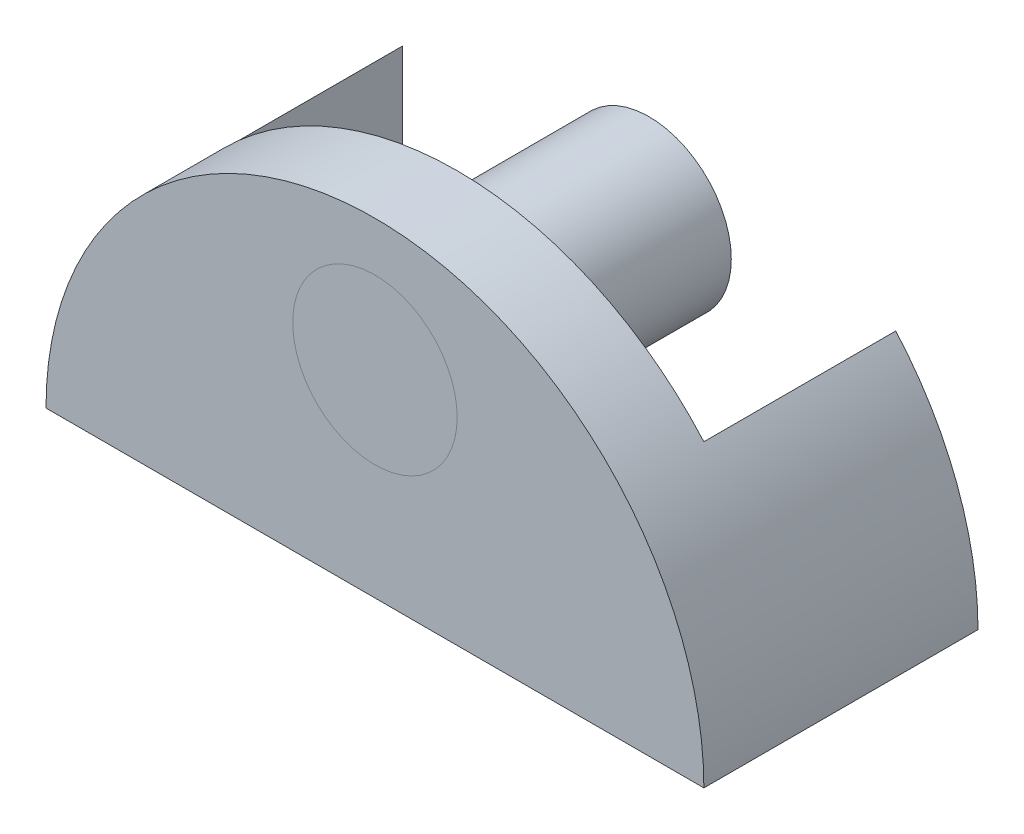
ISO-10303-21;
HEADER;
FILE_DESCRIPTION(('STEP AP214'),'2;1');
FILE_NAME('part.step','',(''),(''),'','','');
FILE_SCHEMA(('AUTOMOTIVE_DESIGN { 1 0 10303 214 1 1 1 1 }'));
ENDSEC;
DATA;
#1=APPLICATION_CONTEXT('core data for automotive mechanical design processes');
#2=APPLICATION_PROTOCOL_DEFINITION('international standard','automotive_design',2000,#1);
#3=PRODUCT_CONTEXT('',#1,'mechanical');
#4=PRODUCT('Part','Part','',(#3));
#5=PRODUCT_RELATED_PRODUCT_CATEGORY('part','',(#4));
#6=PRODUCT_DEFINITION_FORMATION('','',#4);
#7=PRODUCT_DEFINITION_CONTEXT('part definition',#1,'design');
#8=PRODUCT_DEFINITION('design','',#6,#7);
#9=PRODUCT_DEFINITION_SHAPE('','',#8);
#10=(LENGTH_UNIT() NAMED_UNIT(*) SI_UNIT(.MILLI.,.METRE.));
#11=(NAMED_UNIT(*) PLANE_ANGLE_UNIT() SI_UNIT($,.RADIAN.));
#12=(NAMED_UNIT(*) SI_UNIT($,.STERADIAN.) SOLID_ANGLE_UNIT());
#13=UNCERTAINTY_MEASURE_WITH_UNIT(LENGTH_MEASURE(1.E-05),#10,'distance_accuracy_value','');
#14=(GEOMETRIC_REPRESENTATION_CONTEXT(3) GLOBAL_UNCERTAINTY_ASSIGNED_CONTEXT((#13)) GLOBAL_UNIT_ASSIGNED_CONTEXT((#10,
#11,#12)) REPRESENTATION_CONTEXT('',''));
#15=CARTESIAN_POINT('',(0.,0.,0.));
#16=DIRECTION('',(0.,0.,1.));
#17=DIRECTION('',(1.,0.,0.));
#18=AXIS2_PLACEMENT_3D('',#15,#16,#17);
#19=CARTESIAN_POINT('',(0.,0.,65.));
#20=DIRECTION('',(0.,0.,-1.));
#21=DIRECTION('',(-1.,0.,0.));
#22=AXIS2_PLACEMENT_3D('',#19,#20,#21);
#23=CYLINDRICAL_SURFACE('',#22,60.);
#24=DIRECTION('',(0.,0.,-1.));
#25=VECTOR('',#24,1.);
#26=CARTESIAN_POINT('',(60.,0.,65.));
#27=LINE('',#26,#25);
#28=CARTESIAN_POINT('',(60.,0.,65.));
#29=VERTEX_POINT('',#28);
#30=CARTESIAN_POINT('',(60.,0.,15.));
#31=VERTEX_POINT('',#30);
#32=EDGE_CURVE('E126',#29,#31,#27,.T.);
#33=ORIENTED_EDGE('',*,*,#32,.T.);
#34=CARTESIAN_POINT('',(0.,0.,15.));
#35=DIRECTION('',(0.,0.,1.));
#36=DIRECTION('',(1.,0.,0.));
#37=AXIS2_PLACEMENT_3D('',#34,#35,#36);
#38=CIRCLE('',#37,60.);
#39=CARTESIAN_POINT('',(45.,39.6862696659689,15.));
#40=VERTEX_POINT('',#39);
#41=EDGE_CURVE('E108',#31,#40,#38,.T.);
#42=ORIENTED_EDGE('',*,*,#41,.T.);
#43=DIRECTION('',(0.,0.,-1.));
#44=VECTOR('',#43,1.);
#45=CARTESIAN_POINT('',(45.,39.6862696659689,65.));
#46=LINE('',#45,#44);
#47=CARTESIAN_POINT('',(45.,39.6862696659689,50.));
#48=VERTEX_POINT('',#47);
#49=EDGE_CURVE('E194',#48,#40,#46,.T.);
#50=ORIENTED_EDGE('',*,*,#49,.F.);
#51=CARTESIAN_POINT('',(0.,0.,50.));
#52=DIRECTION('',(0.,0.,-1.));
#53=DIRECTION('',(-1.,0.,0.));
#54=AXIS2_PLACEMENT_3D('',#51,#52,#53);
#55=CIRCLE('',#54,60.);
#56=CARTESIAN_POINT('',(-45.,39.6862696659689,50.));
#57=VERTEX_POINT('',#56);
#58=EDGE_CURVE('E273',#57,#48,#55,.T.);
#59=ORIENTED_EDGE('',*,*,#58,.F.);
#60=DIRECTION('',(0.,0.,-1.));
#61=VECTOR('',#60,1.);
#62=CARTESIAN_POINT('',(-45.,39.6862696659689,65.));
#63=LINE('',#62,#61);
#64=CARTESIAN_POINT('',(-45.,39.6862696659689,15.));
#65=VERTEX_POINT('',#64);
#66=EDGE_CURVE('E176',#57,#65,#63,.T.);
#67=ORIENTED_EDGE('',*,*,#66,.T.);
#68=CARTESIAN_POINT('',(-60.,0.,15.));
#69=VERTEX_POINT('',#68);
#70=EDGE_CURVE('E68',#65,#69,#38,.T.);
#71=ORIENTED_EDGE('',*,*,#70,.T.);
#72=DIRECTION('',(0.,0.,-1.));
#73=VECTOR('',#72,1.);
#74=CARTESIAN_POINT('',(-60.,0.,65.));
#75=LINE('',#74,#73);
#76=CARTESIAN_POINT('',(-60.,0.,65.));
#77=VERTEX_POINT('',#76);
#78=EDGE_CURVE('E53',#77,#69,#75,.T.);
#79=ORIENTED_EDGE('',*,*,#78,.F.);
#80=CARTESIAN_POINT('',(0.,0.,65.));
#81=DIRECTION('',(0.,0.,1.));
#82=DIRECTION('',(1.,0.,0.));
#83=AXIS2_PLACEMENT_3D('',#80,#81,#82);
#84=CIRCLE('',#83,60.);
#85=EDGE_CURVE('E136',#29,#77,#84,.T.);
#86=ORIENTED_EDGE('',*,*,#85,.F.);
#87=EDGE_LOOP('',(#33,#42,#50,#59,#67,#71,#79,#86));
#88=FACE_BOUND('',#87,.T.);
#89=ADVANCED_FACE('F50',(#88),#23,.T.);
#90=CARTESIAN_POINT('',(-60.,0.,65.));
#91=DIRECTION('',(0.,1.,0.));
#92=DIRECTION('',(0.,0.,1.));
#93=AXIS2_PLACEMENT_3D('',#90,#91,#92);
#94=PLANE('',#93);
#95=ORIENTED_EDGE('',*,*,#78,.T.);
#96=DIRECTION('',(-1.,0.,0.));
#97=VECTOR('',#96,1.);
#98=CARTESIAN_POINT('',(-60.,0.,15.));
#99=LINE('',#98,#97);
#100=CARTESIAN_POINT('',(-45.,0.,15.));
#101=VERTEX_POINT('',#100);
#102=EDGE_CURVE('E132',#101,#69,#99,.T.);
#103=ORIENTED_EDGE('',*,*,#102,.F.);
#104=DIRECTION('',(0.,0.,-1.));
#105=VECTOR('',#104,1.);
#106=CARTESIAN_POINT('',(-45.,0.,0.));
#107=LINE('',#106,#105);
#108=CARTESIAN_POINT('',(-45.,0.,50.));
#109=VERTEX_POINT('',#108);
#110=EDGE_CURVE('E162',#109,#101,#107,.T.);
#111=ORIENTED_EDGE('',*,*,#110,.F.);
#112=DIRECTION('',(1.,0.,0.));
#113=VECTOR('',#112,1.);
#114=CARTESIAN_POINT('',(0.,0.,50.));
#115=LINE('',#114,#113);
#116=CARTESIAN_POINT('',(45.,0.,50.));
#117=VERTEX_POINT('',#116);
#118=EDGE_CURVE('E76',#109,#117,#115,.T.);
#119=ORIENTED_EDGE('',*,*,#118,.T.);
#120=DIRECTION('',(0.,0.,-1.));
#121=VECTOR('',#120,1.);
#122=CARTESIAN_POINT('',(45.,0.,0.));
#123=LINE('',#122,#121);
#124=CARTESIAN_POINT('',(45.,0.,15.));
#125=VERTEX_POINT('',#124);
#126=EDGE_CURVE('E129',#117,#125,#123,.T.);
#127=ORIENTED_EDGE('',*,*,#126,.T.);
#128=EDGE_CURVE('E112',#31,#125,#99,.T.);
#129=ORIENTED_EDGE('',*,*,#128,.F.);
#130=ORIENTED_EDGE('',*,*,#32,.F.);
#131=DIRECTION('',(1.,0.,0.));
#132=VECTOR('',#131,1.);
#133=CARTESIAN_POINT('',(-60.,0.,65.));
#134=LINE('',#133,#132);
#135=EDGE_CURVE('E138',#77,#29,#134,.T.);
#136=ORIENTED_EDGE('',*,*,#135,.F.);
#137=EDGE_LOOP('',(#95,#103,#111,#119,#127,#129,#130,#136));
#138=FACE_BOUND('',#137,.T.);
#139=ADVANCED_FACE('F125',(#138),#94,.F.);
#140=CARTESIAN_POINT('',(0.,0.,65.));
#141=DIRECTION('',(0.,0.,1.));
#142=DIRECTION('',(1.,0.,0.));
#143=AXIS2_PLACEMENT_3D('',#140,#141,#142);
#144=PLANE('',#143);
#145=CARTESIAN_POINT('',(0.,36.0352165415459,65.));
#146=DIRECTION('',(0.,0.,1.));
#147=DIRECTION('',(1.,0.,0.));
#148=AXIS2_PLACEMENT_3D('',#145,#146,#147);
#149=CIRCLE('',#148,15.);
#150=CARTESIAN_POINT('',(15.,36.0352165415459,65.));
#151=VERTEX_POINT('',#150);
#152=EDGE_CURVE('E12',#151,#151,#149,.T.);
#153=ORIENTED_EDGE('',*,*,#152,.F.);
#154=EDGE_LOOP('',(#153));
#155=FACE_BOUND('',#154,.T.);
#156=ORIENTED_EDGE('',*,*,#85,.T.);
#157=ORIENTED_EDGE('',*,*,#135,.T.);
#158=EDGE_LOOP('',(#156,#157));
#159=FACE_BOUND('',#158,.T.);
#160=ADVANCED_FACE('F253',(#155,#159),#144,.T.);
#161=CARTESIAN_POINT('',(0.,60.,50.));
#162=DIRECTION('',(0.,0.,-1.));
#163=DIRECTION('',(-1.,0.,0.));
#164=AXIS2_PLACEMENT_3D('',#161,#162,#163);
#165=PLANE('',#164);
#166=CARTESIAN_POINT('',(0.,36.0352165415459,50.));
#167=DIRECTION('',(0.,0.,-1.));
#168=DIRECTION('',(-1.,0.,0.));
#169=AXIS2_PLACEMENT_3D('',#166,#167,#168);
#170=CIRCLE('',#169,15.);
#171=CARTESIAN_POINT('',(-15.,36.0352165415459,50.));
#172=VERTEX_POINT('',#171);
#173=EDGE_CURVE('E60',#172,#172,#170,.T.);
#174=ORIENTED_EDGE('',*,*,#173,.F.);
#175=EDGE_LOOP('',(#174));
#176=FACE_BOUND('',#175,.T.);
#177=ORIENTED_EDGE('',*,*,#58,.T.);
#178=DIRECTION('',(0.,-1.,0.));
#179=VECTOR('',#178,1.);
#180=CARTESIAN_POINT('',(45.,60.,50.));
#181=LINE('',#180,#179);
#182=EDGE_CURVE('E172',#48,#117,#181,.T.);
#183=ORIENTED_EDGE('',*,*,#182,.T.);
#184=ORIENTED_EDGE('',*,*,#118,.F.);
#185=DIRECTION('',(0.,-1.,0.));
#186=VECTOR('',#185,1.);
#187=CARTESIAN_POINT('',(-45.,60.,50.));
#188=LINE('',#187,#186);
#189=EDGE_CURVE('E186',#57,#109,#188,.T.);
#190=ORIENTED_EDGE('',*,*,#189,.F.);
#191=EDGE_LOOP('',(#177,#183,#184,#190));
#192=FACE_BOUND('',#191,.T.);
#193=ADVANCED_FACE('F257',(#176,#192),#165,.T.);
#194=CARTESIAN_POINT('',(45.,60.,0.));
#195=DIRECTION('',(-1.,0.,0.));
#196=DIRECTION('',(0.,0.,1.));
#197=AXIS2_PLACEMENT_3D('',#194,#195,#196);
#198=PLANE('',#197);
#199=ORIENTED_EDGE('',*,*,#49,.T.);
#200=DIRECTION('',(0.,-1.,0.));
#201=VECTOR('',#200,1.);
#202=CARTESIAN_POINT('',(45.,60.,15.));
#203=LINE('',#202,#201);
#204=EDGE_CURVE('E114',#40,#125,#203,.T.);
#205=ORIENTED_EDGE('',*,*,#204,.T.);
#206=ORIENTED_EDGE('',*,*,#126,.F.);
#207=ORIENTED_EDGE('',*,*,#182,.F.);
#208=EDGE_LOOP('',(#199,#205,#206,#207));
#209=FACE_BOUND('',#208,.T.);
#210=ADVANCED_FACE('F263',(#209),#198,.T.);
#211=CARTESIAN_POINT('',(-45.,60.,0.));
#212=DIRECTION('',(-1.,0.,0.));
#213=DIRECTION('',(0.,0.,1.));
#214=AXIS2_PLACEMENT_3D('',#211,#212,#213);
#215=PLANE('',#214);
#216=ORIENTED_EDGE('',*,*,#189,.T.);
#217=ORIENTED_EDGE('',*,*,#110,.T.);
#218=DIRECTION('',(0.,-1.,0.));
#219=VECTOR('',#218,1.);
#220=CARTESIAN_POINT('',(-45.,60.,15.));
#221=LINE('',#220,#219);
#222=EDGE_CURVE('E181',#65,#101,#221,.T.);
#223=ORIENTED_EDGE('',*,*,#222,.F.);
#224=ORIENTED_EDGE('',*,*,#66,.F.);
#225=EDGE_LOOP('',(#216,#217,#223,#224));
#226=FACE_BOUND('',#225,.T.);
#227=ADVANCED_FACE('F246',(#226),#215,.F.);
#228=CARTESIAN_POINT('',(0.,36.0352165415459,0.));
#229=DIRECTION('',(0.,0.,1.));
#230=DIRECTION('',(1.,0.,0.));
#231=AXIS2_PLACEMENT_3D('',#228,#229,#230);
#232=CYLINDRICAL_SURFACE('',#231,15.);
#233=ORIENTED_EDGE('',*,*,#173,.T.);
#234=EDGE_LOOP('',(#233));
#235=FACE_BOUND('',#234,.T.);
#236=CARTESIAN_POINT('',(0.,36.0352165415459,15.));
#237=DIRECTION('',(0.,0.,1.));
#238=DIRECTION('',(1.,0.,0.));
#239=AXIS2_PLACEMENT_3D('',#236,#237,#238);
#240=CIRCLE('',#239,15.);
#241=CARTESIAN_POINT('',(15.,36.0352165415459,15.));
#242=VERTEX_POINT('',#241);
#243=EDGE_CURVE('E131',#242,#242,#240,.F.);
#244=ORIENTED_EDGE('',*,*,#243,.F.);
#245=EDGE_LOOP('',(#244));
#246=FACE_BOUND('',#245,.T.);
#247=ADVANCED_FACE('F237',(#235,#246),#232,.T.);
#248=ORIENTED_EDGE('',*,*,#152,.T.);
#249=EDGE_LOOP('',(#248));
#250=FACE_BOUND('',#249,.T.);
#251=CARTESIAN_POINT('',(0.,36.0352165415459,65.000012));
#252=DIRECTION('',(0.,0.,1.));
#253=DIRECTION('',(1.,0.,0.));
#254=AXIS2_PLACEMENT_3D('',#251,#252,#253);
#255=CIRCLE('',#254,15.);
#256=CARTESIAN_POINT('',(15.,36.0352165415459,65.000012));
#257=VERTEX_POINT('',#256);
#258=EDGE_CURVE('E120',#257,#257,#255,.T.);
#259=ORIENTED_EDGE('',*,*,#258,.F.);
#260=EDGE_LOOP('',(#259));
#261=FACE_BOUND('',#260,.T.);
#262=ADVANCED_FACE('F235',(#250,#261),#232,.T.);
#263=CARTESIAN_POINT('',(0.,36.0352165415459,65.000012));
#264=DIRECTION('',(0.,0.,1.));
#265=DIRECTION('',(1.,0.,0.));
#266=AXIS2_PLACEMENT_3D('',#263,#264,#265);
#267=PLANE('',#266);
#268=ORIENTED_EDGE('',*,*,#258,.T.);
#269=EDGE_LOOP('',(#268));
#270=FACE_BOUND('',#269,.T.);
#271=ADVANCED_FACE('F233',(#270),#267,.T.);
#272=CARTESIAN_POINT('',(-60.,60.,15.));
#273=DIRECTION('',(0.,0.,1.));
#274=DIRECTION('',(1.,0.,0.));
#275=AXIS2_PLACEMENT_3D('',#272,#273,#274);
#276=PLANE('',#275);
#277=ORIENTED_EDGE('',*,*,#243,.T.);
#278=EDGE_LOOP('',(#277));
#279=FACE_BOUND('',#278,.T.);
#280=ADVANCED_FACE('F244',(#279),#276,.F.);
#281=ORIENTED_EDGE('',*,*,#222,.T.);
#282=ORIENTED_EDGE('',*,*,#102,.T.);
#283=ORIENTED_EDGE('',*,*,#70,.F.);
#284=EDGE_LOOP('',(#281,#282,#283));
#285=FACE_BOUND('',#284,.T.);
#286=ADVANCED_FACE('F297',(#285),#276,.F.);
#287=ORIENTED_EDGE('',*,*,#128,.T.);
#288=ORIENTED_EDGE('',*,*,#204,.F.);
#289=ORIENTED_EDGE('',*,*,#41,.F.);
#290=EDGE_LOOP('',(#287,#288,#289));
#291=FACE_BOUND('',#290,.T.);
#292=ADVANCED_FACE('F111',(#291),#276,.F.);
#293=CLOSED_SHELL('',(#89,#139,#160,#193,#210,#227,#247,#262,#271,#280,#286,#292));
#294=MANIFOLD_SOLID_BREP('B2',#293);
#295=ADVANCED_BREP_SHAPE_REPRESENTATION('',(#18,#294),#14);
#296=SHAPE_DEFINITION_REPRESENTATION(#9,#295);
ENDSEC;
END-ISO-10303-21;
